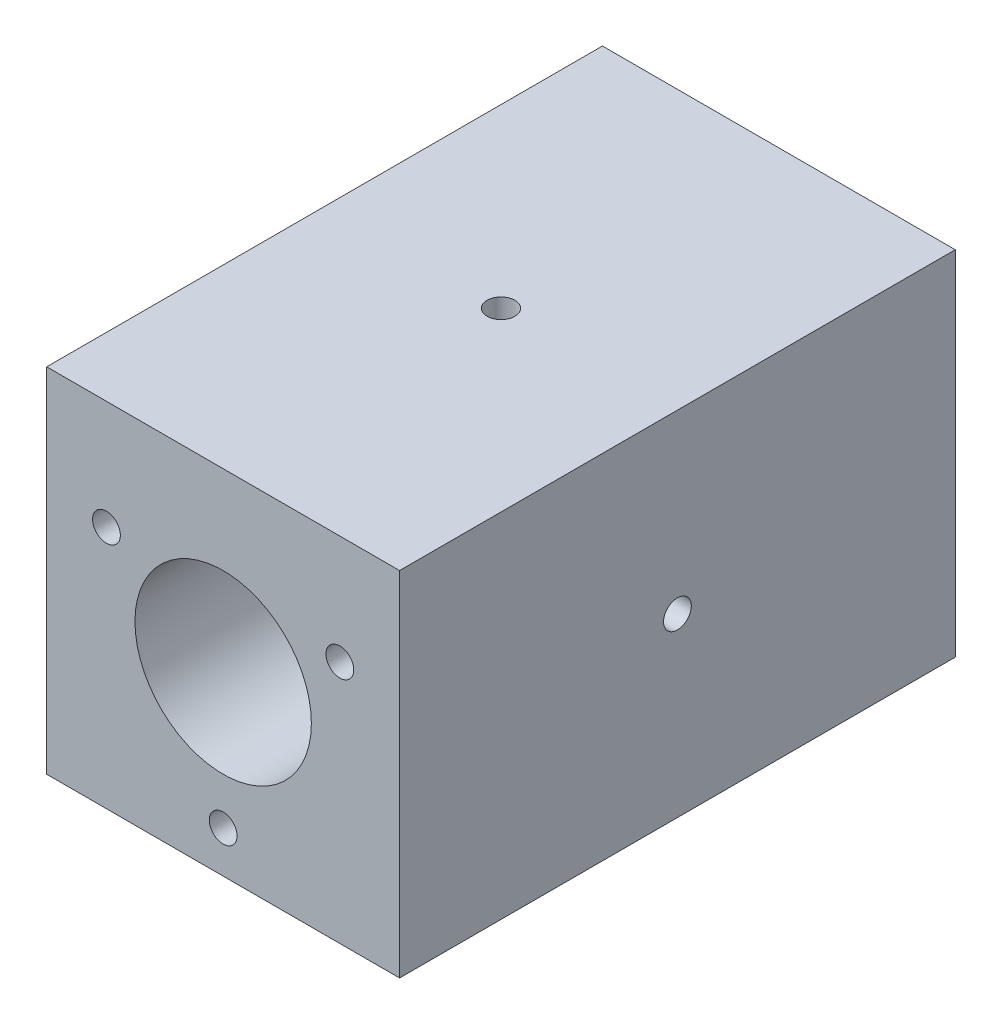
ISO-10303-21;
HEADER;
FILE_DESCRIPTION(('STEP AP214'),'2;1');
FILE_NAME('part.step','',(''),(''),'','','');
FILE_SCHEMA(('AUTOMOTIVE_DESIGN { 1 0 10303 214 1 1 1 1 }'));
ENDSEC;
DATA;
#1=APPLICATION_CONTEXT('core data for automotive mechanical design processes');
#2=APPLICATION_PROTOCOL_DEFINITION('international standard','automotive_design',2000,#1);
#3=PRODUCT_CONTEXT('',#1,'mechanical');
#4=PRODUCT('Part','Part','',(#3));
#5=PRODUCT_RELATED_PRODUCT_CATEGORY('part','',(#4));
#6=PRODUCT_DEFINITION_FORMATION('','',#4);
#7=PRODUCT_DEFINITION_CONTEXT('part definition',#1,'design');
#8=PRODUCT_DEFINITION('design','',#6,#7);
#9=PRODUCT_DEFINITION_SHAPE('','',#8);
#10=(LENGTH_UNIT() NAMED_UNIT(*) SI_UNIT(.MILLI.,.METRE.));
#11=(NAMED_UNIT(*) PLANE_ANGLE_UNIT() SI_UNIT($,.RADIAN.));
#12=(NAMED_UNIT(*) SI_UNIT($,.STERADIAN.) SOLID_ANGLE_UNIT());
#13=UNCERTAINTY_MEASURE_WITH_UNIT(LENGTH_MEASURE(1.E-05),#10,'distance_accuracy_value','');
#14=(GEOMETRIC_REPRESENTATION_CONTEXT(3) GLOBAL_UNCERTAINTY_ASSIGNED_CONTEXT((#13)) GLOBAL_UNIT_ASSIGNED_CONTEXT((#10,
#11,#12)) REPRESENTATION_CONTEXT('',''));
#15=CARTESIAN_POINT('',(0.,0.,0.));
#16=DIRECTION('',(0.,0.,1.));
#17=DIRECTION('',(1.,0.,0.));
#18=AXIS2_PLACEMENT_3D('',#15,#16,#17);
#19=CARTESIAN_POINT('',(0.,0.,25.));
#20=DIRECTION('',(0.,0.,-1.));
#21=DIRECTION('',(-1.,0.,0.));
#22=AXIS2_PLACEMENT_3D('',#19,#20,#21);
#23=PLANE('',#22);
#24=DIRECTION('',(0.,-1.,0.));
#25=VECTOR('',#24,1.);
#26=CARTESIAN_POINT('',(-15.875,15.875,25.));
#27=LINE('',#26,#25);
#28=CARTESIAN_POINT('',(-15.875,15.875,25.));
#29=VERTEX_POINT('',#28);
#30=CARTESIAN_POINT('',(-15.875,-15.875,25.));
#31=VERTEX_POINT('',#30);
#32=EDGE_CURVE('E101',#29,#31,#27,.T.);
#33=ORIENTED_EDGE('',*,*,#32,.T.);
#34=DIRECTION('',(1.,0.,0.));
#35=VECTOR('',#34,1.);
#36=CARTESIAN_POINT('',(15.875,-15.875,25.));
#37=LINE('',#36,#35);
#38=CARTESIAN_POINT('',(15.875,-15.875,25.));
#39=VERTEX_POINT('',#38);
#40=EDGE_CURVE('E96',#31,#39,#37,.T.);
#41=ORIENTED_EDGE('',*,*,#40,.T.);
#42=DIRECTION('',(0.,1.,0.));
#43=VECTOR('',#42,1.);
#44=CARTESIAN_POINT('',(15.875,15.875,25.));
#45=LINE('',#44,#43);
#46=CARTESIAN_POINT('',(15.875,15.875,25.));
#47=VERTEX_POINT('',#46);
#48=EDGE_CURVE('E99',#39,#47,#45,.T.);
#49=ORIENTED_EDGE('',*,*,#48,.T.);
#50=DIRECTION('',(-1.,0.,0.));
#51=VECTOR('',#50,1.);
#52=CARTESIAN_POINT('',(15.875,15.875,25.));
#53=LINE('',#52,#51);
#54=EDGE_CURVE('E66',#47,#29,#53,.T.);
#55=ORIENTED_EDGE('',*,*,#54,.T.);
#56=EDGE_LOOP('',(#33,#41,#49,#55));
#57=FACE_BOUND('',#56,.T.);
#58=CARTESIAN_POINT('',(0.,0.,25.));
#59=DIRECTION('',(0.,0.,1.));
#60=DIRECTION('',(1.,0.,0.));
#61=AXIS2_PLACEMENT_3D('',#58,#59,#60);
#62=CIRCLE('',#61,7.9375);
#63=CARTESIAN_POINT('',(7.93750000000001,0.,25.));
#64=VERTEX_POINT('',#63);
#65=EDGE_CURVE('E116',#64,#64,#62,.T.);
#66=ORIENTED_EDGE('',*,*,#65,.F.);
#67=EDGE_LOOP('',(#66));
#68=FACE_BOUND('',#67,.T.);
#69=CARTESIAN_POINT('',(-10.5,6.06217782649108,25.));
#70=DIRECTION('',(0.,0.,1.));
#71=DIRECTION('',(1.,0.,0.));
#72=AXIS2_PLACEMENT_3D('',#69,#70,#71);
#73=CIRCLE('',#72,1.25);
#74=CARTESIAN_POINT('',(-9.25,6.06217782649108,25.));
#75=VERTEX_POINT('',#74);
#76=EDGE_CURVE('E131',#75,#75,#73,.T.);
#77=ORIENTED_EDGE('',*,*,#76,.F.);
#78=EDGE_LOOP('',(#77));
#79=FACE_BOUND('',#78,.T.);
#80=CARTESIAN_POINT('',(10.5,6.06217782649108,25.));
#81=DIRECTION('',(0.,0.,1.));
#82=DIRECTION('',(1.,0.,0.));
#83=AXIS2_PLACEMENT_3D('',#80,#81,#82);
#84=CIRCLE('',#83,1.25);
#85=CARTESIAN_POINT('',(11.75,6.06217782649108,25.));
#86=VERTEX_POINT('',#85);
#87=EDGE_CURVE('E137',#86,#86,#84,.T.);
#88=ORIENTED_EDGE('',*,*,#87,.F.);
#89=EDGE_LOOP('',(#88));
#90=FACE_BOUND('',#89,.T.);
#91=CARTESIAN_POINT('',(0.,-12.1243556529821,25.));
#92=DIRECTION('',(0.,0.,1.));
#93=DIRECTION('',(1.,0.,0.));
#94=AXIS2_PLACEMENT_3D('',#91,#92,#93);
#95=CIRCLE('',#94,1.25);
#96=CARTESIAN_POINT('',(1.25,-12.1243556529821,25.));
#97=VERTEX_POINT('',#96);
#98=EDGE_CURVE('E143',#97,#97,#95,.T.);
#99=ORIENTED_EDGE('',*,*,#98,.F.);
#100=EDGE_LOOP('',(#99));
#101=FACE_BOUND('',#100,.T.);
#102=ADVANCED_FACE('F49',(#57,#68,#79,#90,#101),#23,.F.);
#103=CARTESIAN_POINT('',(0.,0.,-25.));
#104=DIRECTION('',(0.,0.,-1.));
#105=DIRECTION('',(-1.,0.,0.));
#106=AXIS2_PLACEMENT_3D('',#103,#104,#105);
#107=PLANE('',#106);
#108=CARTESIAN_POINT('',(10.5,6.06217782649108,-25.));
#109=DIRECTION('',(0.,0.,1.));
#110=DIRECTION('',(1.,0.,0.));
#111=AXIS2_PLACEMENT_3D('',#108,#109,#110);
#112=CIRCLE('',#111,1.25);
#113=CARTESIAN_POINT('',(11.75,6.06217782649108,-25.));
#114=VERTEX_POINT('',#113);
#115=EDGE_CURVE('E140',#114,#114,#112,.T.);
#116=ORIENTED_EDGE('',*,*,#115,.T.);
#117=EDGE_LOOP('',(#116));
#118=FACE_BOUND('',#117,.T.);
#119=CARTESIAN_POINT('',(0.,0.,-25.));
#120=DIRECTION('',(0.,0.,1.));
#121=DIRECTION('',(1.,0.,0.));
#122=AXIS2_PLACEMENT_3D('',#119,#120,#121);
#123=CIRCLE('',#122,7.9375);
#124=CARTESIAN_POINT('',(7.93750000000001,0.,-25.));
#125=VERTEX_POINT('',#124);
#126=EDGE_CURVE('E128',#125,#125,#123,.T.);
#127=ORIENTED_EDGE('',*,*,#126,.T.);
#128=EDGE_LOOP('',(#127));
#129=FACE_BOUND('',#128,.T.);
#130=DIRECTION('',(0.,-1.,0.));
#131=VECTOR('',#130,1.);
#132=CARTESIAN_POINT('',(-15.875,15.875,-25.));
#133=LINE('',#132,#131);
#134=CARTESIAN_POINT('',(-15.875,15.875,-25.));
#135=VERTEX_POINT('',#134);
#136=CARTESIAN_POINT('',(-15.875,-15.875,-25.));
#137=VERTEX_POINT('',#136);
#138=EDGE_CURVE('E113',#135,#137,#133,.T.);
#139=ORIENTED_EDGE('',*,*,#138,.F.);
#140=DIRECTION('',(-1.,0.,0.));
#141=VECTOR('',#140,1.);
#142=CARTESIAN_POINT('',(15.875,15.875,-25.));
#143=LINE('',#142,#141);
#144=CARTESIAN_POINT('',(15.875,15.875,-25.));
#145=VERTEX_POINT('',#144);
#146=EDGE_CURVE('E89',#145,#135,#143,.T.);
#147=ORIENTED_EDGE('',*,*,#146,.F.);
#148=DIRECTION('',(0.,1.,0.));
#149=VECTOR('',#148,1.);
#150=CARTESIAN_POINT('',(15.875,15.875,-25.));
#151=LINE('',#150,#149);
#152=CARTESIAN_POINT('',(15.875,-15.875,-25.));
#153=VERTEX_POINT('',#152);
#154=EDGE_CURVE('E83',#153,#145,#151,.T.);
#155=ORIENTED_EDGE('',*,*,#154,.F.);
#156=DIRECTION('',(1.,0.,0.));
#157=VECTOR('',#156,1.);
#158=CARTESIAN_POINT('',(15.875,-15.875,-25.));
#159=LINE('',#158,#157);
#160=EDGE_CURVE('E105',#137,#153,#159,.T.);
#161=ORIENTED_EDGE('',*,*,#160,.F.);
#162=EDGE_LOOP('',(#139,#147,#155,#161));
#163=FACE_BOUND('',#162,.T.);
#164=CARTESIAN_POINT('',(-10.5,6.06217782649108,-25.));
#165=DIRECTION('',(0.,0.,1.));
#166=DIRECTION('',(1.,0.,0.));
#167=AXIS2_PLACEMENT_3D('',#164,#165,#166);
#168=CIRCLE('',#167,1.25);
#169=CARTESIAN_POINT('',(-9.25,6.06217782649108,-25.));
#170=VERTEX_POINT('',#169);
#171=EDGE_CURVE('E134',#170,#170,#168,.T.);
#172=ORIENTED_EDGE('',*,*,#171,.T.);
#173=EDGE_LOOP('',(#172));
#174=FACE_BOUND('',#173,.T.);
#175=CARTESIAN_POINT('',(0.,-12.1243556529821,-25.));
#176=DIRECTION('',(0.,0.,1.));
#177=DIRECTION('',(1.,0.,0.));
#178=AXIS2_PLACEMENT_3D('',#175,#176,#177);
#179=CIRCLE('',#178,1.25);
#180=CARTESIAN_POINT('',(1.25,-12.1243556529821,-25.));
#181=VERTEX_POINT('',#180);
#182=EDGE_CURVE('E146',#181,#181,#179,.T.);
#183=ORIENTED_EDGE('',*,*,#182,.T.);
#184=EDGE_LOOP('',(#183));
#185=FACE_BOUND('',#184,.T.);
#186=ADVANCED_FACE('F124',(#118,#129,#163,#174,#185),#107,.T.);
#187=CARTESIAN_POINT('',(-15.875,15.875,25.));
#188=DIRECTION('',(1.,0.,0.));
#189=DIRECTION('',(0.,1.,0.));
#190=AXIS2_PLACEMENT_3D('',#187,#188,#189);
#191=PLANE('',#190);
#192=ORIENTED_EDGE('',*,*,#138,.T.);
#193=DIRECTION('',(0.,0.,-1.));
#194=VECTOR('',#193,1.);
#195=CARTESIAN_POINT('',(-15.875,-15.875,25.));
#196=LINE('',#195,#194);
#197=EDGE_CURVE('E11',#31,#137,#196,.T.);
#198=ORIENTED_EDGE('',*,*,#197,.F.);
#199=ORIENTED_EDGE('',*,*,#32,.F.);
#200=DIRECTION('',(0.,0.,-1.));
#201=VECTOR('',#200,1.);
#202=CARTESIAN_POINT('',(-15.875,15.875,25.));
#203=LINE('',#202,#201);
#204=EDGE_CURVE('E109',#29,#135,#203,.T.);
#205=ORIENTED_EDGE('',*,*,#204,.T.);
#206=EDGE_LOOP('',(#192,#198,#199,#205));
#207=FACE_BOUND('',#206,.T.);
#208=ADVANCED_FACE('F51',(#207),#191,.F.);
#209=CARTESIAN_POINT('',(15.875,-15.875,25.));
#210=DIRECTION('',(0.,1.,0.));
#211=DIRECTION('',(-1.,0.,0.));
#212=AXIS2_PLACEMENT_3D('',#209,#210,#211);
#213=PLANE('',#212);
#214=ORIENTED_EDGE('',*,*,#160,.T.);
#215=DIRECTION('',(0.,0.,-1.));
#216=VECTOR('',#215,1.);
#217=CARTESIAN_POINT('',(15.875,-15.875,25.));
#218=LINE('',#217,#216);
#219=EDGE_CURVE('E58',#39,#153,#218,.T.);
#220=ORIENTED_EDGE('',*,*,#219,.F.);
#221=ORIENTED_EDGE('',*,*,#40,.F.);
#222=ORIENTED_EDGE('',*,*,#197,.T.);
#223=EDGE_LOOP('',(#214,#220,#221,#222));
#224=FACE_BOUND('',#223,.T.);
#225=ADVANCED_FACE('F104',(#224),#213,.F.);
#226=CARTESIAN_POINT('',(15.875,15.875,25.));
#227=DIRECTION('',(-1.,0.,0.));
#228=DIRECTION('',(0.,-1.,0.));
#229=AXIS2_PLACEMENT_3D('',#226,#227,#228);
#230=PLANE('',#229);
#231=CARTESIAN_POINT('',(15.875,0.,0.));
#232=DIRECTION('',(1.,0.,0.));
#233=DIRECTION('',(0.,0.,-1.));
#234=AXIS2_PLACEMENT_3D('',#231,#232,#233);
#235=CIRCLE('',#234,1.24999999999999);
#236=CARTESIAN_POINT('',(15.875,0.,-1.24999999999999));
#237=VERTEX_POINT('',#236);
#238=EDGE_CURVE('E179',#237,#237,#235,.T.);
#239=ORIENTED_EDGE('',*,*,#238,.F.);
#240=EDGE_LOOP('',(#239));
#241=FACE_BOUND('',#240,.T.);
#242=ORIENTED_EDGE('',*,*,#154,.T.);
#243=DIRECTION('',(0.,0.,-1.));
#244=VECTOR('',#243,1.);
#245=CARTESIAN_POINT('',(15.875,15.875,25.));
#246=LINE('',#245,#244);
#247=EDGE_CURVE('E106',#47,#145,#246,.T.);
#248=ORIENTED_EDGE('',*,*,#247,.F.);
#249=ORIENTED_EDGE('',*,*,#48,.F.);
#250=ORIENTED_EDGE('',*,*,#219,.T.);
#251=EDGE_LOOP('',(#242,#248,#249,#250));
#252=FACE_BOUND('',#251,.T.);
#253=ADVANCED_FACE('F107',(#241,#252),#230,.F.);
#254=CARTESIAN_POINT('',(15.875,15.875,25.));
#255=DIRECTION('',(0.,-1.,0.));
#256=DIRECTION('',(1.,0.,0.));
#257=AXIS2_PLACEMENT_3D('',#254,#255,#256);
#258=PLANE('',#257);
#259=CARTESIAN_POINT('',(0.,15.875,0.));
#260=DIRECTION('',(0.,1.,0.));
#261=DIRECTION('',(0.,0.,1.));
#262=AXIS2_PLACEMENT_3D('',#259,#260,#261);
#263=CIRCLE('',#262,1.25);
#264=CARTESIAN_POINT('',(0.,15.875,1.25));
#265=VERTEX_POINT('',#264);
#266=EDGE_CURVE('E159',#265,#265,#263,.T.);
#267=ORIENTED_EDGE('',*,*,#266,.F.);
#268=EDGE_LOOP('',(#267));
#269=FACE_BOUND('',#268,.T.);
#270=ORIENTED_EDGE('',*,*,#146,.T.);
#271=ORIENTED_EDGE('',*,*,#204,.F.);
#272=ORIENTED_EDGE('',*,*,#54,.F.);
#273=ORIENTED_EDGE('',*,*,#247,.T.);
#274=EDGE_LOOP('',(#270,#271,#272,#273));
#275=FACE_BOUND('',#274,.T.);
#276=ADVANCED_FACE('F121',(#269,#275),#258,.F.);
#277=CARTESIAN_POINT('',(0.,0.,25.));
#278=DIRECTION('',(0.,0.,-1.));
#279=DIRECTION('',(-1.,0.,0.));
#280=AXIS2_PLACEMENT_3D('',#277,#278,#279);
#281=CYLINDRICAL_SURFACE('',#280,7.9375);
#282=CARTESIAN_POINT('',(7.93750000000001,0.,-1.24999999999999));
#283=CARTESIAN_POINT('',(7.93749884526427,-0.0697504150927674,-1.24999715690116));
#284=CARTESIAN_POINT('',(7.93657099739005,-0.139540255432463,-1.24414214042688));
#285=CARTESIAN_POINT('',(7.9329589474276,-0.277166301084599,-1.22088436228467));
#286=CARTESIAN_POINT('',(7.93027307667876,-0.345000586315197,-1.20347062922113));
#287=CARTESIAN_POINT('',(7.92344656155909,-0.476704125127085,-1.15763109928079));
#288=CARTESIAN_POINT('',(7.91930705658603,-0.540576438204386,-1.12921392541241));
#289=CARTESIAN_POINT('',(7.91002969799435,-0.662637137536172,-1.06219591551795));
#290=CARTESIAN_POINT('',(7.90489197232907,-0.720826250836256,-1.02359638445419));
#291=CARTESIAN_POINT('',(7.89413945906247,-0.830376856604447,-0.936956904689493));
#292=CARTESIAN_POINT('',(7.88852131381747,-0.881682542018239,-0.888846800414665));
#293=CARTESIAN_POINT('',(7.8774671865371,-0.975528165248917,-0.784702836989211));
#294=CARTESIAN_POINT('',(7.87203121543035,-1.01806757796236,-0.728668503512718));
#295=CARTESIAN_POINT('',(7.86192437477424,-1.09339319291298,-0.609888015013124));
#296=CARTESIAN_POINT('',(7.85725784468265,-1.12612487509418,-0.547106884300299));
#297=CARTESIAN_POINT('',(7.84926443015854,-1.18055738222958,-0.416852120969527));
#298=CARTESIAN_POINT('',(7.84593746514309,-1.20225887073718,-0.349378770903369));
#299=CARTESIAN_POINT('',(7.84103307296807,-1.23384053416383,-0.21224390385941));
#300=CARTESIAN_POINT('',(7.83944146000214,-1.24381661283797,-0.142604989907457));
#301=CARTESIAN_POINT('',(7.83814498405106,-1.25196148267928,-0.00262482112364988));
#302=CARTESIAN_POINT('',(7.83844000178568,-1.25013102030242,0.0677163890255272));
#303=CARTESIAN_POINT('',(7.8408704904039,-1.23479302959007,0.206423844941958));
#304=CARTESIAN_POINT('',(7.84298906258341,-1.22139271446387,0.274802285082373));
#305=CARTESIAN_POINT('',(7.84880152933236,-1.18346341997124,0.40832798997412));
#306=CARTESIAN_POINT('',(7.85249547261565,-1.15893409647064,0.473475154737981));
#307=CARTESIAN_POINT('',(7.86106095443948,-1.09933280333051,0.599012934343867));
#308=CARTESIAN_POINT('',(7.86593750418005,-1.06421581101909,0.659381817927734));
#309=CARTESIAN_POINT('',(7.87631517667283,-0.984468043254831,0.773410723001881));
#310=CARTESIAN_POINT('',(7.88181634452122,-0.939836580671971,0.82707025950237));
#311=CARTESIAN_POINT('',(7.89289789663712,-0.841740186655551,0.926778309363158));
#312=CARTESIAN_POINT('',(7.89847848488607,-0.78818315923662,0.972736240953957));
#313=CARTESIAN_POINT('',(7.90903379069807,-0.674068754426928,1.05502591003618));
#314=CARTESIAN_POINT('',(7.91400850509368,-0.613511340442199,1.09135759720391));
#315=CARTESIAN_POINT('',(7.92279753342772,-0.48703374878246,1.15336967092633));
#316=CARTESIAN_POINT('',(7.92661103736327,-0.421109868165423,1.17904262699487));
#317=CARTESIAN_POINT('',(7.9326413197818,-0.285812810610449,1.21892741584569));
#318=CARTESIAN_POINT('',(7.93485821736243,-0.216439891363735,1.23314010350756));
#319=CARTESIAN_POINT('',(7.93742962433742,-0.0769953220393042,1.24957943781758));
#320=CARTESIAN_POINT('',(7.93780347008134,-0.00693868750640217,1.25193053627866));
#321=CARTESIAN_POINT('',(7.93669942846577,0.132567999528165,1.24491092364233));
#322=CARTESIAN_POINT('',(7.93522160447956,0.202018072707433,1.2355406137093));
#323=CARTESIAN_POINT('',(7.930592235018,0.337959990056605,1.20544767489133));
#324=CARTESIAN_POINT('',(7.9274496947657,0.404465684077796,1.18478610682746));
#325=CARTESIAN_POINT('',(7.91984198415274,0.533069085734835,1.13276185501904));
#326=CARTESIAN_POINT('',(7.91537674627077,0.595166568138833,1.10139862496167));
#327=CARTESIAN_POINT('',(7.90557144085229,0.713735168663208,1.02857239567006));
#328=CARTESIAN_POINT('',(7.90022469153128,0.770157557562097,0.987030976775549));
#329=CARTESIAN_POINT('',(7.88927112786205,0.875274535241822,0.89513618584503));
#330=CARTESIAN_POINT('',(7.88366429678058,0.923968625902502,0.844782246245802));
#331=CARTESIAN_POINT('',(7.87276064936421,1.01270330904595,0.736135910684062));
#332=CARTESIAN_POINT('',(7.86746715904295,1.05266018369139,0.677774754492342));
#333=CARTESIAN_POINT('',(7.85784984125407,1.12220308672281,0.555095780085868));
#334=CARTESIAN_POINT('',(7.85352598553827,1.15178941724605,0.490778135477524));
#335=CARTESIAN_POINT('',(7.84636196860052,1.19962360576266,0.358254767835383));
#336=CARTESIAN_POINT('',(7.84351618551746,1.21791447707634,0.290064887878343));
#337=CARTESIAN_POINT('',(7.83961594231868,1.24277479070219,0.151532584450695));
#338=CARTESIAN_POINT('',(7.83856134465337,1.24934513306497,0.0811903266889055));
#339=CARTESIAN_POINT('',(7.838368363452,1.25055485297194,-0.0588148871490922));
#340=CARTESIAN_POINT('',(7.83920882920989,1.24532592110439,-0.128476711630321));
#341=CARTESIAN_POINT('',(7.8426651396402,1.22336884225765,-0.265916702805816));
#342=CARTESIAN_POINT('',(7.84528098025903,1.20664072153373,-0.333694873800527));
#343=CARTESIAN_POINT('',(7.85198562458484,1.16220839654518,-0.465400776867293));
#344=CARTESIAN_POINT('',(7.85607306729066,1.13451433170473,-0.529332003205456));
#345=CARTESIAN_POINT('',(7.86526186497778,1.06894952177457,-0.651662089270439));
#346=CARTESIAN_POINT('',(7.87036326131223,1.03107836159943,-0.710060723212201));
#347=CARTESIAN_POINT('',(7.88107276171686,0.94575959555236,-0.820335379737902));
#348=CARTESIAN_POINT('',(7.8866856639543,0.89821472887681,-0.872135695944193));
#349=CARTESIAN_POINT('',(7.89774647155334,0.79510365730607,-0.967068708971834));
#350=CARTESIAN_POINT('',(7.90319433839691,0.739535597042464,-1.01019939540202));
#351=CARTESIAN_POINT('',(7.91334950238607,0.621554416670283,-1.08680660682811));
#352=CARTESIAN_POINT('',(7.91805207548325,0.559101579903618,-1.12022258787847));
#353=CARTESIAN_POINT('',(7.92614067856452,0.429423082762671,-1.17603937605101));
#354=CARTESIAN_POINT('',(7.92952804861362,0.362202363456729,-1.19845140133676));
#355=CARTESIAN_POINT('',(7.93384613614359,0.24558107158262,-1.22663515615439));
#356=CARTESIAN_POINT('',(7.93520917367193,0.196894322586625,-1.23538330462386));
#357=CARTESIAN_POINT('',(7.93703650816938,0.0988116383781604,-1.2470666917814));
#358=CARTESIAN_POINT('',(7.93750081808962,0.0494157133956311,-1.25000201423542));
#359=CARTESIAN_POINT('',(7.93750000000001,0.,-1.24999999999999));
#360=B_SPLINE_CURVE_WITH_KNOTS('',3,(#282,#283,#284,#285,#286,#287,#288,#289,#290,#291,#292,
#293,#294,#295,#296,#297,#298,#299,#300,#301,#302,#303,#304,#305,#306,#307,#308,#309,#310,#311,
#312,#313,#314,#315,#316,#317,#318,#319,#320,#321,#322,#323,#324,#325,#326,#327,#328,#329,#330,
#331,#332,#333,#334,#335,#336,#337,#338,#339,#340,#341,#342,#343,#344,#345,#346,#347,#348,#349,
#350,#351,#352,#353,#354,#355,#356,#357,#358,#359),.UNSPECIFIED.,.T.,.F.,(4,2,2,2,2,2,2,2,2,2,2,
2,2,2,2,2,2,2,2,2,2,2,2,2,2,2,2,2,2,2,2,2,2,2,2,2,2,2,4),(0.,0.209070649752808,
0.418340031189464,0.627445746423542,0.836524675854105,1.0472076740045,1.25790328848955,
1.46974928780809,1.68158254140507,1.89167085055406,2.10174587722381,2.30989486403974,
2.51805028773291,2.72710365769201,2.93617213049288,3.14754909867532,3.35892717186415,
3.57045235592169,3.78196175978216,3.99124732286284,4.20052572335571,4.40868342979393,
4.61685176413649,4.82667739427569,5.03651654304005,5.24828586448026,5.46004901568289,
5.67100071439108,5.88193621285946,6.09052913864055,6.29912158815779,6.50752161585206,
6.71593014468972,6.92654793892305,7.13721451689053,7.34916716807057,7.56090328964163,
7.70902461878047,7.85714381339575),.UNSPECIFIED.);
#361=CARTESIAN_POINT('',(7.93750000000001,0.,-1.24999999999999));
#362=VERTEX_POINT('',#361);
#363=EDGE_CURVE('E173',#362,#362,#360,.T.);
#364=ORIENTED_EDGE('',*,*,#363,.F.);
#365=EDGE_LOOP('',(#364));
#366=FACE_BOUND('',#365,.T.);
#367=CARTESIAN_POINT('',(0.,7.9375,1.25));
#368=CARTESIAN_POINT('',(-0.0697504150927729,7.93749884526426,1.24999715690116));
#369=CARTESIAN_POINT('',(-0.139540255432468,7.93657099739004,1.24414214042688));
#370=CARTESIAN_POINT('',(-0.277166301084606,7.93295894742759,1.22088436228468));
#371=CARTESIAN_POINT('',(-0.345000586315204,7.93027307667875,1.20347062922113));
#372=CARTESIAN_POINT('',(-0.476704125127092,7.92344656155908,1.15763109928079));
#373=CARTESIAN_POINT('',(-0.540576438204393,7.91930705658602,1.12921392541241));
#374=CARTESIAN_POINT('',(-0.66263713753618,7.91002969799434,1.06219591551796));
#375=CARTESIAN_POINT('',(-0.720826250836264,7.90489197232906,1.02359638445419));
#376=CARTESIAN_POINT('',(-0.830376856604455,7.89413945906246,0.936956904689497));
#377=CARTESIAN_POINT('',(-0.881682542018248,7.88852131381746,0.888846800414669));
#378=CARTESIAN_POINT('',(-0.975528165248926,7.87746718653709,0.784702836989215));
#379=CARTESIAN_POINT('',(-1.01806757796237,7.87203121543034,0.728668503512721));
#380=CARTESIAN_POINT('',(-1.09339319291299,7.86192437477423,0.609888015013127));
#381=CARTESIAN_POINT('',(-1.12612487509419,7.85725784468263,0.547106884300301));
#382=CARTESIAN_POINT('',(-1.18055738222959,7.84926443015852,0.416852120969529));
#383=CARTESIAN_POINT('',(-1.20225887073719,7.84593746514307,0.349378770903371));
#384=CARTESIAN_POINT('',(-1.23384053416384,7.84103307296805,0.21224390385941));
#385=CARTESIAN_POINT('',(-1.24381661283798,7.83944146000212,0.142604989907458));
#386=CARTESIAN_POINT('',(-1.25196148267929,7.83814498405104,0.0026248211236497));
#387=CARTESIAN_POINT('',(-1.25013102030243,7.83844000178567,-0.0677163890255276));
#388=CARTESIAN_POINT('',(-1.23479302959008,7.84087049040389,-0.206423844941959));
#389=CARTESIAN_POINT('',(-1.22139271446388,7.84298906258339,-0.274802285082375));
#390=CARTESIAN_POINT('',(-1.18346341997125,7.84880152933235,-0.408327989974122));
#391=CARTESIAN_POINT('',(-1.15893409647065,7.85249547261564,-0.473475154737983));
#392=CARTESIAN_POINT('',(-1.09933280333052,7.86106095443947,-0.599012934343869));
#393=CARTESIAN_POINT('',(-1.0642158110191,7.86593750418003,-0.659381817927736));
#394=CARTESIAN_POINT('',(-0.98446804325484,7.87631517667281,-0.773410723001884));
#395=CARTESIAN_POINT('',(-0.93983658067198,7.8818163445212,-0.827070259502373));
#396=CARTESIAN_POINT('',(-0.84174018665556,7.89289789663711,-0.926778309363161));
#397=CARTESIAN_POINT('',(-0.788183159236628,7.89847848488606,-0.97273624095396));
#398=CARTESIAN_POINT('',(-0.674068754426936,7.90903379069806,-1.05502591003619));
#399=CARTESIAN_POINT('',(-0.613511340442207,7.91400850509367,-1.09135759720391));
#400=CARTESIAN_POINT('',(-0.487033748782468,7.92279753342771,-1.15336967092634));
#401=CARTESIAN_POINT('',(-0.42110986816543,7.92661103736326,-1.17904262699488));
#402=CARTESIAN_POINT('',(-0.285812810610455,7.93264131978179,-1.2189274158457));
#403=CARTESIAN_POINT('',(-0.216439891363741,7.93485821736242,-1.23314010350756));
#404=CARTESIAN_POINT('',(-0.07699532203931,7.93742962433741,-1.24957943781759));
#405=CARTESIAN_POINT('',(-0.00693868750640761,7.93780347008132,-1.25193053627867));
#406=CARTESIAN_POINT('',(0.13256799952816,7.93669942846577,-1.24491092364233));
#407=CARTESIAN_POINT('',(0.202018072707429,7.93522160447955,-1.2355406137093));
#408=CARTESIAN_POINT('',(0.337959990056601,7.93059223501799,-1.20544767489133));
#409=CARTESIAN_POINT('',(0.404465684077792,7.92744969476569,-1.18478610682746));
#410=CARTESIAN_POINT('',(0.533069085734832,7.91984198415273,-1.13276185501904));
#411=CARTESIAN_POINT('',(0.59516656813883,7.91537674627076,-1.10139862496168));
#412=CARTESIAN_POINT('',(0.713735168663206,7.90557144085228,-1.02857239567006));
#413=CARTESIAN_POINT('',(0.770157557562095,7.90022469153127,-0.987030976775553));
#414=CARTESIAN_POINT('',(0.87527453524182,7.88927112786204,-0.895136185845034));
#415=CARTESIAN_POINT('',(0.923968625902501,7.88366429678057,-0.844782246245806));
#416=CARTESIAN_POINT('',(1.01270330904595,7.8727606493642,-0.736135910684065));
#417=CARTESIAN_POINT('',(1.05266018369139,7.86746715904294,-0.677774754492345));
#418=CARTESIAN_POINT('',(1.12220308672281,7.85784984125406,-0.555095780085871));
#419=CARTESIAN_POINT('',(1.15178941724604,7.85352598553826,-0.490778135477527));
#420=CARTESIAN_POINT('',(1.19962360576266,7.84636196860052,-0.358254767835385));
#421=CARTESIAN_POINT('',(1.21791447707634,7.84351618551746,-0.290064887878345));
#422=CARTESIAN_POINT('',(1.24277479070219,7.83961594231868,-0.151532584450696));
#423=CARTESIAN_POINT('',(1.24934513306497,7.83856134465336,-0.081190326688906));
#424=CARTESIAN_POINT('',(1.25055485297194,7.83836836345199,0.0588148871490924));
#425=CARTESIAN_POINT('',(1.24532592110439,7.83920882920988,0.128476711630321));
#426=CARTESIAN_POINT('',(1.22336884225765,7.84266513964019,0.265916702805817));
#427=CARTESIAN_POINT('',(1.20664072153373,7.84528098025902,0.333694873800528));
#428=CARTESIAN_POINT('',(1.16220839654518,7.85198562458483,0.465400776867295));
#429=CARTESIAN_POINT('',(1.13451433170473,7.85607306729065,0.529332003205459));
#430=CARTESIAN_POINT('',(1.06894952177457,7.86526186497777,0.651662089270441));
#431=CARTESIAN_POINT('',(1.03107836159943,7.87036326131223,0.710060723212204));
#432=CARTESIAN_POINT('',(0.945759595552359,7.88107276171685,0.820335379737906));
#433=CARTESIAN_POINT('',(0.898214728876809,7.88668566395429,0.872135695944197));
#434=CARTESIAN_POINT('',(0.795103657306068,7.89774647155333,0.967068708971838));
#435=CARTESIAN_POINT('',(0.739535597042462,7.90319433839689,1.01019939540203));
#436=CARTESIAN_POINT('',(0.62155441667028,7.91334950238606,1.08680660682812));
#437=CARTESIAN_POINT('',(0.559101579903616,7.91805207548324,1.12022258787847));
#438=CARTESIAN_POINT('',(0.429423082762668,7.92614067856451,1.17603937605102));
#439=CARTESIAN_POINT('',(0.362202363456725,7.92952804861361,1.19845140133677));
#440=CARTESIAN_POINT('',(0.245581071582616,7.93384613614358,1.22663515615439));
#441=CARTESIAN_POINT('',(0.196894322586621,7.93520917367192,1.23538330462386));
#442=CARTESIAN_POINT('',(0.0988116383781559,7.93703650816937,1.2470666917814));
#443=CARTESIAN_POINT('',(0.0494157133956262,7.93750081808961,1.25000201423542));
#444=CARTESIAN_POINT('',(0.,7.9375,1.25));
#445=B_SPLINE_CURVE_WITH_KNOTS('',3,(#367,#368,#369,#370,#371,#372,#373,#374,#375,#376,#377,
#378,#379,#380,#381,#382,#383,#384,#385,#386,#387,#388,#389,#390,#391,#392,#393,#394,#395,#396,
#397,#398,#399,#400,#401,#402,#403,#404,#405,#406,#407,#408,#409,#410,#411,#412,#413,#414,#415,
#416,#417,#418,#419,#420,#421,#422,#423,#424,#425,#426,#427,#428,#429,#430,#431,#432,#433,#434,
#435,#436,#437,#438,#439,#440,#441,#442,#443,#444),.UNSPECIFIED.,.T.,.F.,(4,2,2,2,2,2,2,2,2,2,2,
2,2,2,2,2,2,2,2,2,2,2,2,2,2,2,2,2,2,2,2,2,2,2,2,2,2,2,4),(0.,0.209070649752809,
0.418340031189465,0.627445746423545,0.836524675854109,1.04720767400451,1.25790328848956,
1.4697492878081,1.68158254140508,1.89167085055407,2.10174587722382,2.30989486403976,
2.51805028773292,2.72710365769202,2.93617213049289,3.14754909867534,3.35892717186417,
3.57045235592171,3.78196175978217,3.99124732286286,4.20052572335573,4.40868342979395,
4.61685176413651,4.82667739427572,5.03651654304007,5.24828586448028,5.46004901568291,
5.6710007143911,5.88193621285949,6.09052913864058,6.29912158815782,6.50752161585209,
6.71593014468975,6.92654793892308,7.13721451689057,7.34916716807061,7.56090328964167,
7.7090246187805,7.85714381339579),.UNSPECIFIED.);
#446=CARTESIAN_POINT('',(0.,7.9375,1.25));
#447=VERTEX_POINT('',#446);
#448=EDGE_CURVE('E149',#447,#447,#445,.T.);
#449=ORIENTED_EDGE('',*,*,#448,.F.);
#450=EDGE_LOOP('',(#449));
#451=FACE_BOUND('',#450,.T.);
#452=ORIENTED_EDGE('',*,*,#65,.T.);
#453=EDGE_LOOP('',(#452));
#454=FACE_BOUND('',#453,.T.);
#455=ORIENTED_EDGE('',*,*,#126,.F.);
#456=EDGE_LOOP('',(#455));
#457=FACE_BOUND('',#456,.T.);
#458=ADVANCED_FACE('F191',(#366,#451,#454,#457),#281,.F.);
#459=CARTESIAN_POINT('',(-10.5,6.06217782649108,25.));
#460=DIRECTION('',(0.,0.,-1.));
#461=DIRECTION('',(-1.,0.,0.));
#462=AXIS2_PLACEMENT_3D('',#459,#460,#461);
#463=CYLINDRICAL_SURFACE('',#462,1.25);
#464=ORIENTED_EDGE('',*,*,#76,.T.);
#465=EDGE_LOOP('',(#464));
#466=FACE_BOUND('',#465,.T.);
#467=ORIENTED_EDGE('',*,*,#171,.F.);
#468=EDGE_LOOP('',(#467));
#469=FACE_BOUND('',#468,.T.);
#470=ADVANCED_FACE('F205',(#466,#469),#463,.F.);
#471=CARTESIAN_POINT('',(10.5,6.06217782649108,25.));
#472=DIRECTION('',(0.,0.,-1.));
#473=DIRECTION('',(-1.,0.,0.));
#474=AXIS2_PLACEMENT_3D('',#471,#472,#473);
#475=CYLINDRICAL_SURFACE('',#474,1.25);
#476=ORIENTED_EDGE('',*,*,#87,.T.);
#477=EDGE_LOOP('',(#476));
#478=FACE_BOUND('',#477,.T.);
#479=ORIENTED_EDGE('',*,*,#115,.F.);
#480=EDGE_LOOP('',(#479));
#481=FACE_BOUND('',#480,.T.);
#482=ADVANCED_FACE('F209',(#478,#481),#475,.F.);
#483=CARTESIAN_POINT('',(0.,-12.1243556529821,25.));
#484=DIRECTION('',(0.,0.,-1.));
#485=DIRECTION('',(-1.,0.,0.));
#486=AXIS2_PLACEMENT_3D('',#483,#484,#485);
#487=CYLINDRICAL_SURFACE('',#486,1.25);
#488=ORIENTED_EDGE('',*,*,#98,.T.);
#489=EDGE_LOOP('',(#488));
#490=FACE_BOUND('',#489,.T.);
#491=ORIENTED_EDGE('',*,*,#182,.F.);
#492=EDGE_LOOP('',(#491));
#493=FACE_BOUND('',#492,.T.);
#494=ADVANCED_FACE('F168',(#490,#493),#487,.F.);
#495=CARTESIAN_POINT('',(0.,15.875,0.));
#496=DIRECTION('',(0.,1.,0.));
#497=DIRECTION('',(0.,0.,1.));
#498=AXIS2_PLACEMENT_3D('',#495,#496,#497);
#499=CYLINDRICAL_SURFACE('',#498,1.25);
#500=ORIENTED_EDGE('',*,*,#266,.T.);
#501=EDGE_LOOP('',(#500));
#502=FACE_BOUND('',#501,.T.);
#503=ORIENTED_EDGE('',*,*,#448,.T.);
#504=EDGE_LOOP('',(#503));
#505=FACE_BOUND('',#504,.T.);
#506=ADVANCED_FACE('F163',(#502,#505),#499,.F.);
#507=CARTESIAN_POINT('',(15.875,0.,0.));
#508=DIRECTION('',(1.,0.,0.));
#509=DIRECTION('',(0.,0.,-1.));
#510=AXIS2_PLACEMENT_3D('',#507,#508,#509);
#511=CYLINDRICAL_SURFACE('',#510,1.24999999999999);
#512=ORIENTED_EDGE('',*,*,#238,.T.);
#513=EDGE_LOOP('',(#512));
#514=FACE_BOUND('',#513,.T.);
#515=ORIENTED_EDGE('',*,*,#363,.T.);
#516=EDGE_LOOP('',(#515));
#517=FACE_BOUND('',#516,.T.);
#518=ADVANCED_FACE('F167',(#514,#517),#511,.F.);
#519=CLOSED_SHELL('',(#102,#186,#208,#225,#253,#276,#458,#470,#482,#494,#506,#518));
#520=MANIFOLD_SOLID_BREP('B2',#519);
#521=ADVANCED_BREP_SHAPE_REPRESENTATION('',(#18,#520),#14);
#522=SHAPE_DEFINITION_REPRESENTATION(#9,#521);
ENDSEC;
END-ISO-10303-21;
